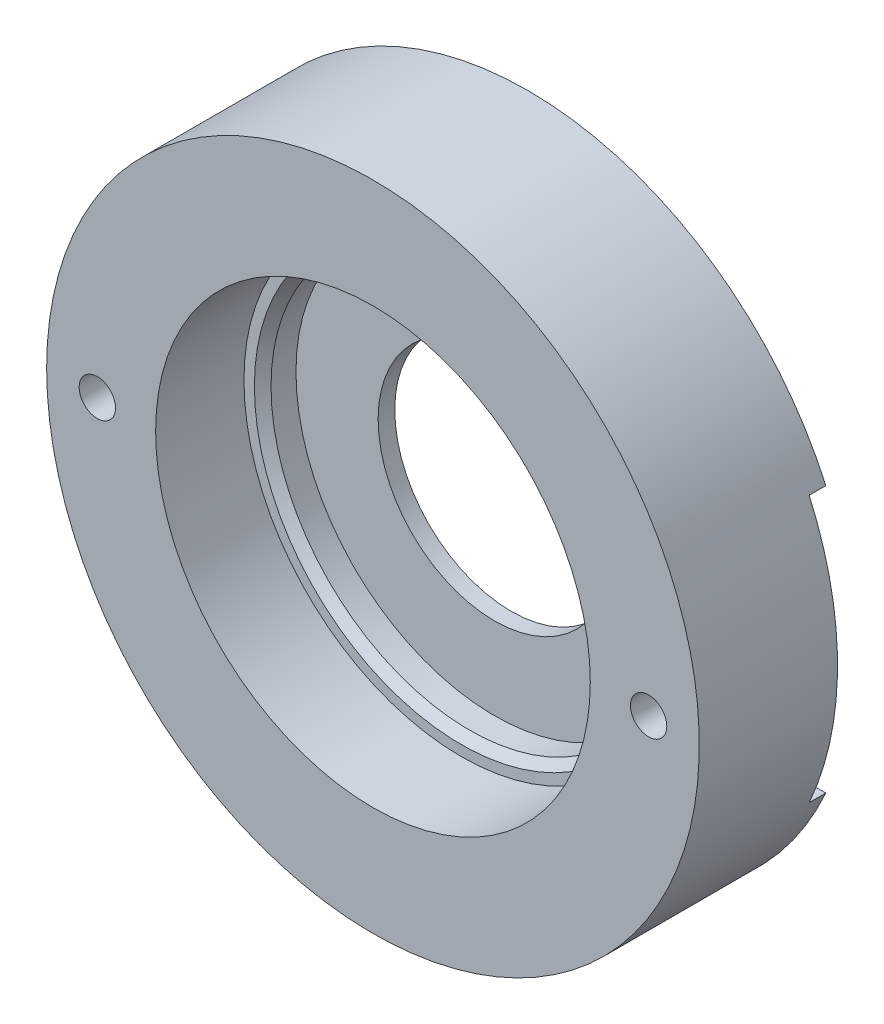
ISO-10303-21;
HEADER;
FILE_DESCRIPTION(('STEP AP214'),'2;1');
FILE_NAME('part.step','',(''),(''),'','','');
FILE_SCHEMA(('AUTOMOTIVE_DESIGN { 1 0 10303 214 1 1 1 1 }'));
ENDSEC;
DATA;
#1=APPLICATION_CONTEXT('core data for automotive mechanical design processes');
#2=APPLICATION_PROTOCOL_DEFINITION('international standard','automotive_design',2000,#1);
#3=PRODUCT_CONTEXT('',#1,'mechanical');
#4=PRODUCT('Part','Part','',(#3));
#5=PRODUCT_RELATED_PRODUCT_CATEGORY('part','',(#4));
#6=PRODUCT_DEFINITION_FORMATION('','',#4);
#7=PRODUCT_DEFINITION_CONTEXT('part definition',#1,'design');
#8=PRODUCT_DEFINITION('design','',#6,#7);
#9=PRODUCT_DEFINITION_SHAPE('','',#8);
#10=(LENGTH_UNIT() NAMED_UNIT(*) SI_UNIT(.MILLI.,.METRE.));
#11=(NAMED_UNIT(*) PLANE_ANGLE_UNIT() SI_UNIT($,.RADIAN.));
#12=(NAMED_UNIT(*) SI_UNIT($,.STERADIAN.) SOLID_ANGLE_UNIT());
#13=UNCERTAINTY_MEASURE_WITH_UNIT(LENGTH_MEASURE(1.E-05),#10,'distance_accuracy_value','');
#14=(GEOMETRIC_REPRESENTATION_CONTEXT(3) GLOBAL_UNCERTAINTY_ASSIGNED_CONTEXT((#13)) GLOBAL_UNIT_ASSIGNED_CONTEXT((#10,
#11,#12)) REPRESENTATION_CONTEXT('',''));
#15=CARTESIAN_POINT('',(0.,0.,0.));
#16=DIRECTION('',(0.,0.,1.));
#17=DIRECTION('',(1.,0.,0.));
#18=AXIS2_PLACEMENT_3D('',#15,#16,#17);
#19=CARTESIAN_POINT('',(0.,0.,-3.52547346479343));
#20=DIRECTION('',(0.,0.,-1.));
#21=DIRECTION('',(-1.,0.,0.));
#22=AXIS2_PLACEMENT_3D('',#19,#20,#21);
#23=PLANE('',#22);
#24=DIRECTION('',(-1.,0.,0.));
#25=VECTOR('',#24,1.);
#26=CARTESIAN_POINT('',(22.5619464921962,-8.,-3.52547346479343));
#27=LINE('',#26,#25);
#28=CARTESIAN_POINT('',(17.9125330984532,-8.,-3.52547346479343));
#29=VERTEX_POINT('',#28);
#30=CARTESIAN_POINT('',(-17.9125330984532,-8.,-3.52547346479343));
#31=VERTEX_POINT('',#30);
#32=EDGE_CURVE('E91',#29,#31,#27,.T.);
#33=ORIENTED_EDGE('',*,*,#32,.F.);
#34=CARTESIAN_POINT('',(0.,0.,-3.52547346479343));
#35=DIRECTION('',(0.,0.,-1.));
#36=DIRECTION('',(-1.,0.,0.));
#37=AXIS2_PLACEMENT_3D('',#34,#35,#36);
#38=CIRCLE('',#37,19.6178195017485);
#39=EDGE_CURVE('E97',#29,#31,#38,.T.);
#40=ORIENTED_EDGE('',*,*,#39,.T.);
#41=EDGE_LOOP('',(#33,#40));
#42=FACE_BOUND('',#41,.T.);
#43=ADVANCED_FACE('F37',(#42),#23,.T.);
#44=CARTESIAN_POINT('',(0.,0.,-25.4112856059014));
#45=DIRECTION('',(0.,0.,-1.));
#46=DIRECTION('',(-1.,0.,0.));
#47=AXIS2_PLACEMENT_3D('',#44,#45,#46);
#48=CYLINDRICAL_SURFACE('',#47,7.);
#49=CARTESIAN_POINT('',(0.,0.,-1.52547346479343));
#50=DIRECTION('',(0.,0.,-1.));
#51=DIRECTION('',(-1.,0.,0.));
#52=AXIS2_PLACEMENT_3D('',#49,#50,#51);
#53=CIRCLE('',#52,7.);
#54=CARTESIAN_POINT('',(-7.,0.,-1.52547346479343));
#55=VERTEX_POINT('',#54);
#56=EDGE_CURVE('E193',#55,#55,#53,.T.);
#57=ORIENTED_EDGE('',*,*,#56,.F.);
#58=EDGE_LOOP('',(#57));
#59=FACE_BOUND('',#58,.T.);
#60=CARTESIAN_POINT('',(0.,0.,-2.52547346479343));
#61=DIRECTION('',(0.,0.,-1.));
#62=DIRECTION('',(-1.,0.,0.));
#63=AXIS2_PLACEMENT_3D('',#60,#61,#62);
#64=CIRCLE('',#63,7.);
#65=CARTESIAN_POINT('',(-7.,0.,-2.52547346479343));
#66=VERTEX_POINT('',#65);
#67=EDGE_CURVE('E201',#66,#66,#64,.F.);
#68=ORIENTED_EDGE('',*,*,#67,.F.);
#69=EDGE_LOOP('',(#68));
#70=FACE_BOUND('',#69,.T.);
#71=ADVANCED_FACE('F126',(#59,#70),#48,.F.);
#72=CARTESIAN_POINT('',(-16.57,0.,5.78452653520657));
#73=DIRECTION('',(0.,0.,-1.));
#74=DIRECTION('',(-1.,0.,0.));
#75=AXIS2_PLACEMENT_3D('',#72,#73,#74);
#76=CYLINDRICAL_SURFACE('',#75,1.0922);
#77=CARTESIAN_POINT('',(-16.57,0.,5.78452653520657));
#78=DIRECTION('',(0.,0.,-1.));
#79=DIRECTION('',(-1.,0.,0.));
#80=AXIS2_PLACEMENT_3D('',#77,#78,#79);
#81=CIRCLE('',#80,1.0922);
#82=CARTESIAN_POINT('',(-17.6622,0.,5.78452653520657));
#83=VERTEX_POINT('',#82);
#84=EDGE_CURVE('E179',#83,#83,#81,.T.);
#85=ORIENTED_EDGE('',*,*,#84,.F.);
#86=EDGE_LOOP('',(#85));
#87=FACE_BOUND('',#86,.T.);
#88=CARTESIAN_POINT('',(-16.57,0.,-2.52547346479343));
#89=DIRECTION('',(0.,0.,-1.));
#90=DIRECTION('',(-1.,0.,0.));
#91=AXIS2_PLACEMENT_3D('',#88,#89,#90);
#92=CIRCLE('',#91,1.0922);
#93=CARTESIAN_POINT('',(-17.6622,0.,-2.52547346479343));
#94=VERTEX_POINT('',#93);
#95=EDGE_CURVE('E106',#94,#94,#92,.F.);
#96=ORIENTED_EDGE('',*,*,#95,.F.);
#97=EDGE_LOOP('',(#96));
#98=FACE_BOUND('',#97,.T.);
#99=ADVANCED_FACE('F131',(#87,#98),#76,.F.);
#100=CARTESIAN_POINT('',(16.57,0.,5.78452653520657));
#101=DIRECTION('',(0.,0.,-1.));
#102=DIRECTION('',(-1.,0.,0.));
#103=AXIS2_PLACEMENT_3D('',#100,#101,#102);
#104=CYLINDRICAL_SURFACE('',#103,1.0922);
#105=CARTESIAN_POINT('',(16.57,0.,5.78452653520657));
#106=DIRECTION('',(0.,0.,-1.));
#107=DIRECTION('',(1.,0.,0.));
#108=AXIS2_PLACEMENT_3D('',#105,#106,#107);
#109=CIRCLE('',#108,1.0922);
#110=CARTESIAN_POINT('',(17.6622,0.,5.78452653520657));
#111=VERTEX_POINT('',#110);
#112=EDGE_CURVE('E175',#111,#111,#109,.T.);
#113=ORIENTED_EDGE('',*,*,#112,.F.);
#114=EDGE_LOOP('',(#113));
#115=FACE_BOUND('',#114,.T.);
#116=CARTESIAN_POINT('',(16.57,0.,-2.52547346479343));
#117=DIRECTION('',(0.,0.,-1.));
#118=DIRECTION('',(-1.,0.,0.));
#119=AXIS2_PLACEMENT_3D('',#116,#117,#118);
#120=CIRCLE('',#119,1.0922);
#121=CARTESIAN_POINT('',(15.4778,0.,-2.52547346479343));
#122=VERTEX_POINT('',#121);
#123=EDGE_CURVE('E104',#122,#122,#120,.F.);
#124=ORIENTED_EDGE('',*,*,#123,.F.);
#125=EDGE_LOOP('',(#124));
#126=FACE_BOUND('',#125,.T.);
#127=ADVANCED_FACE('F137',(#115,#126),#104,.F.);
#128=DIRECTION('',(1.,0.,0.));
#129=VECTOR('',#128,1.);
#130=CARTESIAN_POINT('',(22.5619464921962,8.,-3.52547346479343));
#131=LINE('',#130,#129);
#132=CARTESIAN_POINT('',(-17.9125330984532,8.,-3.52547346479343));
#133=VERTEX_POINT('',#132);
#134=CARTESIAN_POINT('',(17.9125330984532,8.,-3.52547346479343));
#135=VERTEX_POINT('',#134);
#136=EDGE_CURVE('E80',#133,#135,#131,.T.);
#137=ORIENTED_EDGE('',*,*,#136,.F.);
#138=EDGE_CURVE('E86',#133,#135,#38,.T.);
#139=ORIENTED_EDGE('',*,*,#138,.T.);
#140=EDGE_LOOP('',(#137,#139));
#141=FACE_BOUND('',#140,.T.);
#142=ADVANCED_FACE('F90',(#141),#23,.T.);
#143=CARTESIAN_POINT('',(0.,0.,-25.4112856059014));
#144=DIRECTION('',(0.,0.,-1.));
#145=DIRECTION('',(-1.,0.,0.));
#146=AXIS2_PLACEMENT_3D('',#143,#144,#145);
#147=CYLINDRICAL_SURFACE('',#146,19.6178195017485);
#148=DIRECTION('',(0.,0.,-1.));
#149=VECTOR('',#148,1.);
#150=CARTESIAN_POINT('',(17.9125330984532,-8.,-25.4112856059014));
#151=LINE('',#150,#149);
#152=CARTESIAN_POINT('',(17.9125330984532,-8.,-2.52547346479343));
#153=VERTEX_POINT('',#152);
#154=EDGE_CURVE('E110',#153,#29,#151,.T.);
#155=ORIENTED_EDGE('',*,*,#154,.F.);
#156=CARTESIAN_POINT('',(0.,0.,-2.52547346479343));
#157=DIRECTION('',(0.,0.,-1.));
#158=DIRECTION('',(-1.,0.,0.));
#159=AXIS2_PLACEMENT_3D('',#156,#157,#158);
#160=CIRCLE('',#159,19.6178195017485);
#161=CARTESIAN_POINT('',(17.9125330984532,8.,-2.52547346479343));
#162=VERTEX_POINT('',#161);
#163=EDGE_CURVE('E198',#153,#162,#160,.F.);
#164=ORIENTED_EDGE('',*,*,#163,.T.);
#165=DIRECTION('',(0.,0.,-1.));
#166=VECTOR('',#165,1.);
#167=CARTESIAN_POINT('',(17.9125330984532,8.,-25.4112856059014));
#168=LINE('',#167,#166);
#169=EDGE_CURVE('E60',#135,#162,#168,.F.);
#170=ORIENTED_EDGE('',*,*,#169,.F.);
#171=ORIENTED_EDGE('',*,*,#138,.F.);
#172=DIRECTION('',(0.,0.,-1.));
#173=VECTOR('',#172,1.);
#174=CARTESIAN_POINT('',(-17.9125330984532,8.,-25.4112856059014));
#175=LINE('',#174,#173);
#176=CARTESIAN_POINT('',(-17.9125330984532,8.,-2.52547346479343));
#177=VERTEX_POINT('',#176);
#178=EDGE_CURVE('E77',#177,#133,#175,.T.);
#179=ORIENTED_EDGE('',*,*,#178,.F.);
#180=CARTESIAN_POINT('',(-17.9125330984532,-8.,-2.52547346479343));
#181=VERTEX_POINT('',#180);
#182=EDGE_CURVE('E199',#177,#181,#160,.F.);
#183=ORIENTED_EDGE('',*,*,#182,.T.);
#184=DIRECTION('',(0.,0.,-1.));
#185=VECTOR('',#184,1.);
#186=CARTESIAN_POINT('',(-17.9125330984532,-8.,-25.4112856059014));
#187=LINE('',#186,#185);
#188=EDGE_CURVE('E85',#31,#181,#187,.F.);
#189=ORIENTED_EDGE('',*,*,#188,.F.);
#190=ORIENTED_EDGE('',*,*,#39,.F.);
#191=EDGE_LOOP('',(#155,#164,#170,#171,#179,#183,#189,#190));
#192=FACE_BOUND('',#191,.T.);
#193=CARTESIAN_POINT('',(0.,0.,5.78452653520657));
#194=DIRECTION('',(0.,0.,-1.));
#195=DIRECTION('',(-1.,0.,0.));
#196=AXIS2_PLACEMENT_3D('',#193,#194,#195);
#197=CIRCLE('',#196,19.6178195017485);
#198=CARTESIAN_POINT('',(-19.6178195017485,0.,5.78452653520657));
#199=VERTEX_POINT('',#198);
#200=EDGE_CURVE('E100',#199,#199,#197,.T.);
#201=ORIENTED_EDGE('',*,*,#200,.T.);
#202=EDGE_LOOP('',(#201));
#203=FACE_BOUND('',#202,.T.);
#204=ADVANCED_FACE('F94',(#192,#203),#147,.T.);
#205=CARTESIAN_POINT('',(0.,0.,5.78452653520657));
#206=DIRECTION('',(0.,0.,-1.));
#207=DIRECTION('',(-1.,0.,0.));
#208=AXIS2_PLACEMENT_3D('',#205,#206,#207);
#209=PLANE('',#208);
#210=ORIENTED_EDGE('',*,*,#112,.T.);
#211=EDGE_LOOP('',(#210));
#212=FACE_BOUND('',#211,.T.);
#213=ORIENTED_EDGE('',*,*,#84,.T.);
#214=EDGE_LOOP('',(#213));
#215=FACE_BOUND('',#214,.T.);
#216=ORIENTED_EDGE('',*,*,#200,.F.);
#217=EDGE_LOOP('',(#216));
#218=FACE_BOUND('',#217,.T.);
#219=CARTESIAN_POINT('',(0.,0.,5.78452653520657));
#220=DIRECTION('',(0.,0.,-1.));
#221=DIRECTION('',(-1.,0.,0.));
#222=AXIS2_PLACEMENT_3D('',#219,#220,#221);
#223=CIRCLE('',#222,13.0646195017485);
#224=CARTESIAN_POINT('',(-13.0646195017485,0.,5.78452653520657));
#225=VERTEX_POINT('',#224);
#226=EDGE_CURVE('E185',#225,#225,#223,.T.);
#227=ORIENTED_EDGE('',*,*,#226,.T.);
#228=EDGE_LOOP('',(#227));
#229=FACE_BOUND('',#228,.T.);
#230=ADVANCED_FACE('F142',(#212,#215,#218,#229),#209,.F.);
#231=CARTESIAN_POINT('',(0.,0.,-25.4112856059014));
#232=DIRECTION('',(0.,0.,-1.));
#233=DIRECTION('',(-1.,0.,0.));
#234=AXIS2_PLACEMENT_3D('',#231,#232,#233);
#235=CYLINDRICAL_SURFACE('',#234,13.0646195017485);
#236=ORIENTED_EDGE('',*,*,#226,.F.);
#237=EDGE_LOOP('',(#236));
#238=FACE_BOUND('',#237,.T.);
#239=CARTESIAN_POINT('',(0.,0.,0.474526535206573));
#240=DIRECTION('',(0.,0.,-1.));
#241=DIRECTION('',(-1.,0.,0.));
#242=AXIS2_PLACEMENT_3D('',#239,#240,#241);
#243=CIRCLE('',#242,13.0646195017485);
#244=CARTESIAN_POINT('',(-13.0646195017485,0.,0.474526535206573));
#245=VERTEX_POINT('',#244);
#246=EDGE_CURVE('E186',#245,#245,#243,.T.);
#247=ORIENTED_EDGE('',*,*,#246,.T.);
#248=EDGE_LOOP('',(#247));
#249=FACE_BOUND('',#248,.T.);
#250=ADVANCED_FACE('F165',(#238,#249),#235,.F.);
#251=CARTESIAN_POINT('',(0.,0.,0.474526535206571));
#252=DIRECTION('',(0.,0.,-1.));
#253=DIRECTION('',(-1.,0.,0.));
#254=AXIS2_PLACEMENT_3D('',#251,#252,#253);
#255=PLANE('',#254);
#256=CARTESIAN_POINT('',(0.,0.,0.474526535206571));
#257=DIRECTION('',(0.,0.,-1.));
#258=DIRECTION('',(-1.,0.,0.));
#259=AXIS2_PLACEMENT_3D('',#256,#257,#258);
#260=CIRCLE('',#259,12.438);
#261=CARTESIAN_POINT('',(-12.438,0.,0.474526535206571));
#262=VERTEX_POINT('',#261);
#263=EDGE_CURVE('E45',#262,#262,#260,.T.);
#264=ORIENTED_EDGE('',*,*,#263,.T.);
#265=EDGE_LOOP('',(#264));
#266=FACE_BOUND('',#265,.T.);
#267=ORIENTED_EDGE('',*,*,#246,.F.);
#268=EDGE_LOOP('',(#267));
#269=FACE_BOUND('',#268,.T.);
#270=ADVANCED_FACE('F114',(#266,#269),#255,.F.);
#271=CARTESIAN_POINT('',(0.,0.,-25.4112856059014));
#272=DIRECTION('',(0.,0.,-1.));
#273=DIRECTION('',(-1.,0.,0.));
#274=AXIS2_PLACEMENT_3D('',#271,#272,#273);
#275=CYLINDRICAL_SURFACE('',#274,11.938);
#276=CARTESIAN_POINT('',(0.,0.,-0.0254734647934171));
#277=DIRECTION('',(0.,0.,-1.));
#278=DIRECTION('',(-1.,0.,0.));
#279=AXIS2_PLACEMENT_3D('',#276,#277,#278);
#280=CIRCLE('',#279,11.938);
#281=CARTESIAN_POINT('',(-11.938,0.,-0.0254734647934171));
#282=VERTEX_POINT('',#281);
#283=EDGE_CURVE('E11',#282,#282,#280,.F.);
#284=ORIENTED_EDGE('',*,*,#283,.T.);
#285=EDGE_LOOP('',(#284));
#286=FACE_BOUND('',#285,.T.);
#287=CARTESIAN_POINT('',(0.,0.,-1.52547346479343));
#288=DIRECTION('',(0.,0.,-1.));
#289=DIRECTION('',(-1.,0.,0.));
#290=AXIS2_PLACEMENT_3D('',#287,#288,#289);
#291=CIRCLE('',#290,11.938);
#292=CARTESIAN_POINT('',(-11.938,0.,-1.52547346479343));
#293=VERTEX_POINT('',#292);
#294=EDGE_CURVE('E188',#293,#293,#291,.T.);
#295=ORIENTED_EDGE('',*,*,#294,.T.);
#296=EDGE_LOOP('',(#295));
#297=FACE_BOUND('',#296,.T.);
#298=ADVANCED_FACE('F158',(#286,#297),#275,.F.);
#299=CARTESIAN_POINT('',(0.,0.,-1.52547346479343));
#300=DIRECTION('',(0.,0.,-1.));
#301=DIRECTION('',(-1.,0.,0.));
#302=AXIS2_PLACEMENT_3D('',#299,#300,#301);
#303=PLANE('',#302);
#304=ORIENTED_EDGE('',*,*,#294,.F.);
#305=EDGE_LOOP('',(#304));
#306=FACE_BOUND('',#305,.T.);
#307=ORIENTED_EDGE('',*,*,#56,.T.);
#308=EDGE_LOOP('',(#307));
#309=FACE_BOUND('',#308,.T.);
#310=ADVANCED_FACE('F154',(#306,#309),#303,.F.);
#311=CARTESIAN_POINT('',(0.,0.,-2.52547346479343));
#312=DIRECTION('',(0.,0.,-1.));
#313=DIRECTION('',(-1.,0.,0.));
#314=AXIS2_PLACEMENT_3D('',#311,#312,#313);
#315=PLANE('',#314);
#316=DIRECTION('',(-1.,0.,0.));
#317=VECTOR('',#316,1.);
#318=CARTESIAN_POINT('',(22.5619464921962,-8.,-2.52547346479343));
#319=LINE('',#318,#317);
#320=EDGE_CURVE('E52',#153,#181,#319,.T.);
#321=ORIENTED_EDGE('',*,*,#320,.T.);
#322=ORIENTED_EDGE('',*,*,#182,.F.);
#323=DIRECTION('',(1.,0.,0.));
#324=VECTOR('',#323,1.);
#325=CARTESIAN_POINT('',(22.5619464921962,8.,-2.52547346479343));
#326=LINE('',#325,#324);
#327=EDGE_CURVE('E81',#177,#162,#326,.T.);
#328=ORIENTED_EDGE('',*,*,#327,.T.);
#329=ORIENTED_EDGE('',*,*,#163,.F.);
#330=EDGE_LOOP('',(#321,#322,#328,#329));
#331=FACE_BOUND('',#330,.T.);
#332=ORIENTED_EDGE('',*,*,#123,.T.);
#333=EDGE_LOOP('',(#332));
#334=FACE_BOUND('',#333,.T.);
#335=ORIENTED_EDGE('',*,*,#95,.T.);
#336=EDGE_LOOP('',(#335));
#337=FACE_BOUND('',#336,.T.);
#338=ORIENTED_EDGE('',*,*,#67,.T.);
#339=EDGE_LOOP('',(#338));
#340=FACE_BOUND('',#339,.T.);
#341=ADVANCED_FACE('F157',(#331,#334,#337,#340),#315,.T.);
#342=CARTESIAN_POINT('',(22.5619464921962,-8.,-2.52547346479343));
#343=DIRECTION('',(0.,-1.,0.));
#344=DIRECTION('',(0.,0.,-1.));
#345=AXIS2_PLACEMENT_3D('',#342,#343,#344);
#346=PLANE('',#345);
#347=ORIENTED_EDGE('',*,*,#188,.T.);
#348=ORIENTED_EDGE('',*,*,#320,.F.);
#349=ORIENTED_EDGE('',*,*,#154,.T.);
#350=ORIENTED_EDGE('',*,*,#32,.T.);
#351=EDGE_LOOP('',(#347,#348,#349,#350));
#352=FACE_BOUND('',#351,.T.);
#353=ADVANCED_FACE('F122',(#352),#346,.F.);
#354=CARTESIAN_POINT('',(22.5619464921962,8.,-2.52547346479343));
#355=DIRECTION('',(0.,1.,0.));
#356=DIRECTION('',(0.,0.,1.));
#357=AXIS2_PLACEMENT_3D('',#354,#355,#356);
#358=PLANE('',#357);
#359=ORIENTED_EDGE('',*,*,#169,.T.);
#360=ORIENTED_EDGE('',*,*,#327,.F.);
#361=ORIENTED_EDGE('',*,*,#178,.T.);
#362=ORIENTED_EDGE('',*,*,#136,.T.);
#363=EDGE_LOOP('',(#359,#360,#361,#362));
#364=FACE_BOUND('',#363,.T.);
#365=ADVANCED_FACE('F79',(#364),#358,.F.);
#366=CARTESIAN_POINT('',(0.,0.,0.474526535206573));
#367=DIRECTION('',(0.,0.,1.));
#368=DIRECTION('',(1.,0.,0.));
#369=AXIS2_PLACEMENT_3D('',#366,#367,#368);
#370=CONICAL_SURFACE('',#369,12.438,0.785398163397447);
#371=ORIENTED_EDGE('',*,*,#283,.F.);
#372=EDGE_LOOP('',(#371));
#373=FACE_BOUND('',#372,.T.);
#374=ORIENTED_EDGE('',*,*,#263,.F.);
#375=EDGE_LOOP('',(#374));
#376=FACE_BOUND('',#375,.T.);
#377=ADVANCED_FACE('F39',(#373,#376),#370,.F.);
#378=CLOSED_SHELL('',(#43,#71,#99,#127,#142,#204,#230,#250,#270,#298,#310,#341,#353,#365,#377));
#379=MANIFOLD_SOLID_BREP('B2',#378);
#380=ADVANCED_BREP_SHAPE_REPRESENTATION('',(#18,#379),#14);
#381=SHAPE_DEFINITION_REPRESENTATION(#9,#380);
ENDSEC;
END-ISO-10303-21;
